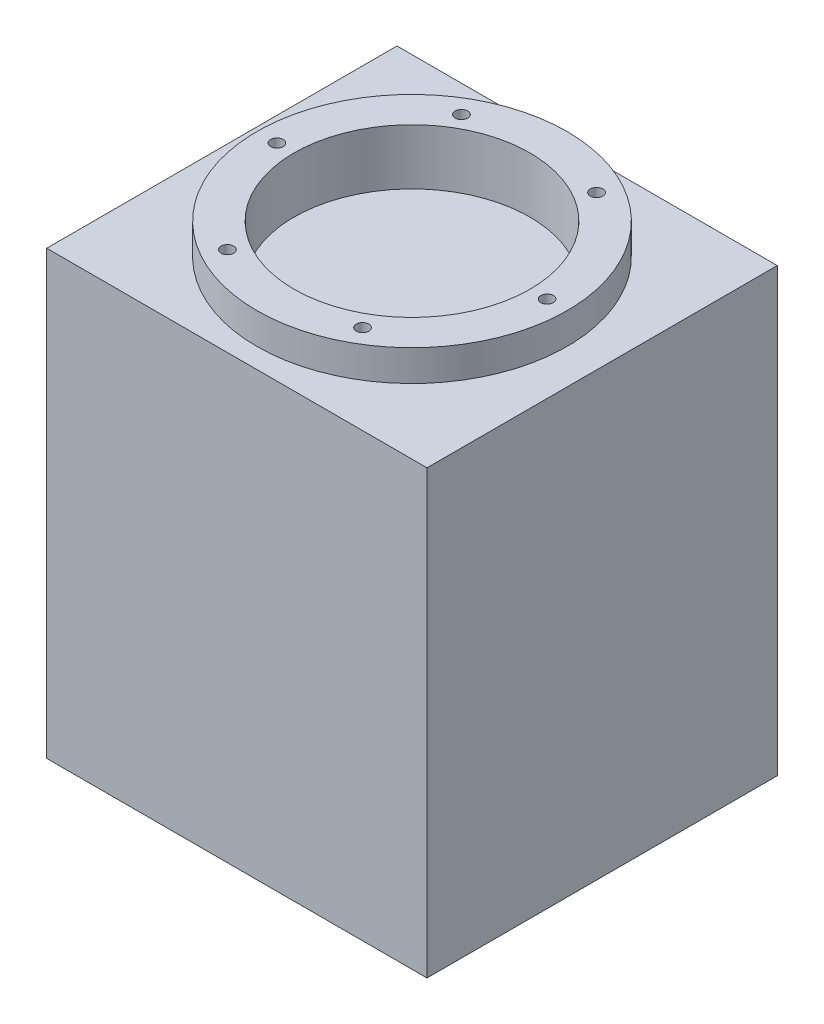
ISO-10303-21;
HEADER;
FILE_DESCRIPTION(('STEP AP214'),'2;1');
FILE_NAME('part.step','',(''),(''),'','','');
FILE_SCHEMA(('AUTOMOTIVE_DESIGN { 1 0 10303 214 1 1 1 1 }'));
ENDSEC;
DATA;
#1=APPLICATION_CONTEXT('core data for automotive mechanical design processes');
#2=APPLICATION_PROTOCOL_DEFINITION('international standard','automotive_design',2000,#1);
#3=PRODUCT_CONTEXT('',#1,'mechanical');
#4=PRODUCT('Part','Part','',(#3));
#5=PRODUCT_RELATED_PRODUCT_CATEGORY('part','',(#4));
#6=PRODUCT_DEFINITION_FORMATION('','',#4);
#7=PRODUCT_DEFINITION_CONTEXT('part definition',#1,'design');
#8=PRODUCT_DEFINITION('design','',#6,#7);
#9=PRODUCT_DEFINITION_SHAPE('','',#8);
#10=(LENGTH_UNIT() NAMED_UNIT(*) SI_UNIT(.MILLI.,.METRE.));
#11=(NAMED_UNIT(*) PLANE_ANGLE_UNIT() SI_UNIT($,.RADIAN.));
#12=(NAMED_UNIT(*) SI_UNIT($,.STERADIAN.) SOLID_ANGLE_UNIT());
#13=UNCERTAINTY_MEASURE_WITH_UNIT(LENGTH_MEASURE(1.E-05),#10,'distance_accuracy_value','');
#14=(GEOMETRIC_REPRESENTATION_CONTEXT(3) GLOBAL_UNCERTAINTY_ASSIGNED_CONTEXT((#13)) GLOBAL_UNIT_ASSIGNED_CONTEXT((#10,
#11,#12)) REPRESENTATION_CONTEXT('',''));
#15=CARTESIAN_POINT('',(0.,0.,0.));
#16=DIRECTION('',(0.,0.,1.));
#17=DIRECTION('',(1.,0.,0.));
#18=AXIS2_PLACEMENT_3D('',#15,#16,#17);
#19=CARTESIAN_POINT('',(38.,88.3,35.));
#20=DIRECTION('',(-1.,0.,0.));
#21=DIRECTION('',(0.,0.,1.));
#22=AXIS2_PLACEMENT_3D('',#19,#20,#21);
#23=PLANE('',#22);
#24=DIRECTION('',(0.,0.,-1.));
#25=VECTOR('',#24,1.);
#26=CARTESIAN_POINT('',(38.,0.,35.));
#27=LINE('',#26,#25);
#28=CARTESIAN_POINT('',(38.,0.,35.));
#29=VERTEX_POINT('',#28);
#30=CARTESIAN_POINT('',(38.,0.,-35.));
#31=VERTEX_POINT('',#30);
#32=EDGE_CURVE('E157',#29,#31,#27,.T.);
#33=ORIENTED_EDGE('',*,*,#32,.T.);
#34=DIRECTION('',(0.,-1.,0.));
#35=VECTOR('',#34,1.);
#36=CARTESIAN_POINT('',(38.,88.3,-35.));
#37=LINE('',#36,#35);
#38=CARTESIAN_POINT('',(38.,88.3,-35.));
#39=VERTEX_POINT('',#38);
#40=EDGE_CURVE('E43',#39,#31,#37,.T.);
#41=ORIENTED_EDGE('',*,*,#40,.F.);
#42=DIRECTION('',(0.,0.,-1.));
#43=VECTOR('',#42,1.);
#44=CARTESIAN_POINT('',(38.,88.3,35.));
#45=LINE('',#44,#43);
#46=CARTESIAN_POINT('',(38.,88.3,35.));
#47=VERTEX_POINT('',#46);
#48=EDGE_CURVE('E159',#47,#39,#45,.T.);
#49=ORIENTED_EDGE('',*,*,#48,.F.);
#50=DIRECTION('',(0.,-1.,0.));
#51=VECTOR('',#50,1.);
#52=CARTESIAN_POINT('',(38.,88.3,35.));
#53=LINE('',#52,#51);
#54=EDGE_CURVE('E165',#47,#29,#53,.T.);
#55=ORIENTED_EDGE('',*,*,#54,.T.);
#56=EDGE_LOOP('',(#33,#41,#49,#55));
#57=FACE_BOUND('',#56,.T.);
#58=ADVANCED_FACE('F40',(#57),#23,.F.);
#59=CARTESIAN_POINT('',(-38.,88.3,-35.));
#60=DIRECTION('',(0.,0.,1.));
#61=DIRECTION('',(1.,0.,0.));
#62=AXIS2_PLACEMENT_3D('',#59,#60,#61);
#63=PLANE('',#62);
#64=DIRECTION('',(-1.,0.,0.));
#65=VECTOR('',#64,1.);
#66=CARTESIAN_POINT('',(-38.,0.,-35.));
#67=LINE('',#66,#65);
#68=CARTESIAN_POINT('',(-38.,0.,-35.));
#69=VERTEX_POINT('',#68);
#70=EDGE_CURVE('E168',#31,#69,#67,.T.);
#71=ORIENTED_EDGE('',*,*,#70,.T.);
#72=DIRECTION('',(0.,-1.,0.));
#73=VECTOR('',#72,1.);
#74=CARTESIAN_POINT('',(-38.,88.3,-35.));
#75=LINE('',#74,#73);
#76=CARTESIAN_POINT('',(-38.,88.3,-35.));
#77=VERTEX_POINT('',#76);
#78=EDGE_CURVE('E174',#77,#69,#75,.T.);
#79=ORIENTED_EDGE('',*,*,#78,.F.);
#80=DIRECTION('',(-1.,0.,0.));
#81=VECTOR('',#80,1.);
#82=CARTESIAN_POINT('',(-38.,88.3,-35.));
#83=LINE('',#82,#81);
#84=EDGE_CURVE('E89',#39,#77,#83,.T.);
#85=ORIENTED_EDGE('',*,*,#84,.F.);
#86=ORIENTED_EDGE('',*,*,#40,.T.);
#87=EDGE_LOOP('',(#71,#79,#85,#86));
#88=FACE_BOUND('',#87,.T.);
#89=ADVANCED_FACE('F177',(#88),#63,.F.);
#90=CARTESIAN_POINT('',(-38.,88.3,35.));
#91=DIRECTION('',(1.,0.,0.));
#92=DIRECTION('',(0.,0.,-1.));
#93=AXIS2_PLACEMENT_3D('',#90,#91,#92);
#94=PLANE('',#93);
#95=DIRECTION('',(0.,0.,1.));
#96=VECTOR('',#95,1.);
#97=CARTESIAN_POINT('',(-38.,0.,35.));
#98=LINE('',#97,#96);
#99=CARTESIAN_POINT('',(-38.,0.,35.));
#100=VERTEX_POINT('',#99);
#101=EDGE_CURVE('E75',#69,#100,#98,.T.);
#102=ORIENTED_EDGE('',*,*,#101,.T.);
#103=DIRECTION('',(0.,-1.,0.));
#104=VECTOR('',#103,1.);
#105=CARTESIAN_POINT('',(-38.,88.3,35.));
#106=LINE('',#105,#104);
#107=CARTESIAN_POINT('',(-38.,88.3,35.));
#108=VERTEX_POINT('',#107);
#109=EDGE_CURVE('E173',#108,#100,#106,.T.);
#110=ORIENTED_EDGE('',*,*,#109,.F.);
#111=DIRECTION('',(0.,0.,1.));
#112=VECTOR('',#111,1.);
#113=CARTESIAN_POINT('',(-38.,88.3,35.));
#114=LINE('',#113,#112);
#115=EDGE_CURVE('E162',#77,#108,#114,.T.);
#116=ORIENTED_EDGE('',*,*,#115,.F.);
#117=ORIENTED_EDGE('',*,*,#78,.T.);
#118=EDGE_LOOP('',(#102,#110,#116,#117));
#119=FACE_BOUND('',#118,.T.);
#120=ADVANCED_FACE('F202',(#119),#94,.F.);
#121=CARTESIAN_POINT('',(-38.,88.3,35.));
#122=DIRECTION('',(0.,0.,-1.));
#123=DIRECTION('',(-1.,0.,0.));
#124=AXIS2_PLACEMENT_3D('',#121,#122,#123);
#125=PLANE('',#124);
#126=DIRECTION('',(1.,0.,0.));
#127=VECTOR('',#126,1.);
#128=CARTESIAN_POINT('',(-38.,0.,35.));
#129=LINE('',#128,#127);
#130=EDGE_CURVE('E81',#100,#29,#129,.T.);
#131=ORIENTED_EDGE('',*,*,#130,.T.);
#132=ORIENTED_EDGE('',*,*,#54,.F.);
#133=DIRECTION('',(1.,0.,0.));
#134=VECTOR('',#133,1.);
#135=CARTESIAN_POINT('',(-38.,88.3,35.));
#136=LINE('',#135,#134);
#137=EDGE_CURVE('E57',#108,#47,#136,.T.);
#138=ORIENTED_EDGE('',*,*,#137,.F.);
#139=ORIENTED_EDGE('',*,*,#109,.T.);
#140=EDGE_LOOP('',(#131,#132,#138,#139));
#141=FACE_BOUND('',#140,.T.);
#142=ADVANCED_FACE('F194',(#141),#125,.F.);
#143=CARTESIAN_POINT('',(0.,88.3,0.));
#144=DIRECTION('',(0.,-1.,0.));
#145=DIRECTION('',(0.,0.,-1.));
#146=AXIS2_PLACEMENT_3D('',#143,#144,#145);
#147=PLANE('',#146);
#148=CARTESIAN_POINT('',(0.,88.3,0.));
#149=DIRECTION('',(0.,1.,0.));
#150=DIRECTION('',(0.,0.,1.));
#151=AXIS2_PLACEMENT_3D('',#148,#149,#150);
#152=CIRCLE('',#151,31.);
#153=CARTESIAN_POINT('',(0.,88.3,31.));
#154=VERTEX_POINT('',#153);
#155=EDGE_CURVE('E11',#154,#154,#152,.T.);
#156=ORIENTED_EDGE('',*,*,#155,.F.);
#157=EDGE_LOOP('',(#156));
#158=FACE_BOUND('',#157,.T.);
#159=ORIENTED_EDGE('',*,*,#48,.T.);
#160=ORIENTED_EDGE('',*,*,#84,.T.);
#161=ORIENTED_EDGE('',*,*,#115,.T.);
#162=ORIENTED_EDGE('',*,*,#137,.T.);
#163=EDGE_LOOP('',(#159,#160,#161,#162));
#164=FACE_BOUND('',#163,.T.);
#165=ADVANCED_FACE('F185',(#158,#164),#147,.F.);
#166=CARTESIAN_POINT('',(0.,0.,0.));
#167=DIRECTION('',(0.,-1.,0.));
#168=DIRECTION('',(0.,0.,-1.));
#169=AXIS2_PLACEMENT_3D('',#166,#167,#168);
#170=PLANE('',#169);
#171=ORIENTED_EDGE('',*,*,#32,.F.);
#172=ORIENTED_EDGE('',*,*,#130,.F.);
#173=ORIENTED_EDGE('',*,*,#101,.F.);
#174=ORIENTED_EDGE('',*,*,#70,.F.);
#175=EDGE_LOOP('',(#171,#172,#173,#174));
#176=FACE_BOUND('',#175,.T.);
#177=ADVANCED_FACE('F182',(#176),#170,.T.);
#178=CARTESIAN_POINT('',(0.,94.5,0.));
#179=DIRECTION('',(0.,-1.,0.));
#180=DIRECTION('',(0.,0.,-1.));
#181=AXIS2_PLACEMENT_3D('',#178,#179,#180);
#182=CYLINDRICAL_SURFACE('',#181,31.);
#183=CARTESIAN_POINT('',(0.,94.5,0.));
#184=DIRECTION('',(0.,1.,0.));
#185=DIRECTION('',(0.,0.,1.));
#186=AXIS2_PLACEMENT_3D('',#183,#184,#185);
#187=CIRCLE('',#186,31.);
#188=CARTESIAN_POINT('',(0.,94.5,31.));
#189=VERTEX_POINT('',#188);
#190=EDGE_CURVE('E155',#189,#189,#187,.T.);
#191=ORIENTED_EDGE('',*,*,#190,.F.);
#192=EDGE_LOOP('',(#191));
#193=FACE_BOUND('',#192,.T.);
#194=ORIENTED_EDGE('',*,*,#155,.T.);
#195=EDGE_LOOP('',(#194));
#196=FACE_BOUND('',#195,.T.);
#197=ADVANCED_FACE('F184',(#193,#196),#182,.T.);
#198=CARTESIAN_POINT('',(0.,94.5,0.));
#199=DIRECTION('',(0.,1.,0.));
#200=DIRECTION('',(0.,0.,1.));
#201=AXIS2_PLACEMENT_3D('',#198,#199,#200);
#202=PLANE('',#201);
#203=CARTESIAN_POINT('',(0.,94.5,0.));
#204=DIRECTION('',(0.,1.,0.));
#205=DIRECTION('',(0.,0.,1.));
#206=AXIS2_PLACEMENT_3D('',#203,#204,#205);
#207=CIRCLE('',#206,23.5888023744465);
#208=CARTESIAN_POINT('',(0.,94.5,23.5888023744465));
#209=VERTEX_POINT('',#208);
#210=EDGE_CURVE('E390',#209,#209,#207,.T.);
#211=ORIENTED_EDGE('',*,*,#210,.F.);
#212=EDGE_LOOP('',(#211));
#213=FACE_BOUND('',#212,.T.);
#214=CARTESIAN_POINT('',(13.5000000000003,94.5,-23.3826859021797));
#215=DIRECTION('',(0.,1.,0.));
#216=DIRECTION('',(0.,0.,1.));
#217=AXIS2_PLACEMENT_3D('',#214,#215,#216);
#218=CIRCLE('',#217,1.24999999999999);
#219=CARTESIAN_POINT('',(13.5000000000003,94.5,-22.1326859021797));
#220=VERTEX_POINT('',#219);
#221=EDGE_CURVE('E119',#220,#220,#218,.T.);
#222=ORIENTED_EDGE('',*,*,#221,.F.);
#223=EDGE_LOOP('',(#222));
#224=FACE_BOUND('',#223,.T.);
#225=CARTESIAN_POINT('',(-13.4999999999998,94.5,-23.38268590218));
#226=DIRECTION('',(0.,1.,0.));
#227=DIRECTION('',(0.,0.,1.));
#228=AXIS2_PLACEMENT_3D('',#225,#226,#227);
#229=CIRCLE('',#228,1.24999999999999);
#230=CARTESIAN_POINT('',(-13.4999999999998,94.5,-22.13268590218));
#231=VERTEX_POINT('',#230);
#232=EDGE_CURVE('E118',#231,#231,#229,.T.);
#233=ORIENTED_EDGE('',*,*,#232,.F.);
#234=EDGE_LOOP('',(#233));
#235=FACE_BOUND('',#234,.T.);
#236=CARTESIAN_POINT('',(-27.,94.5,0.));
#237=DIRECTION('',(0.,1.,0.));
#238=DIRECTION('',(0.,0.,1.));
#239=AXIS2_PLACEMENT_3D('',#236,#237,#238);
#240=CIRCLE('',#239,1.24999999999999);
#241=CARTESIAN_POINT('',(-27.,94.5,1.24999999999999));
#242=VERTEX_POINT('',#241);
#243=EDGE_CURVE('E131',#242,#242,#240,.T.);
#244=ORIENTED_EDGE('',*,*,#243,.F.);
#245=EDGE_LOOP('',(#244));
#246=FACE_BOUND('',#245,.T.);
#247=CARTESIAN_POINT('',(-13.5000000000001,94.5,23.3826859021798));
#248=DIRECTION('',(0.,1.,0.));
#249=DIRECTION('',(0.,0.,1.));
#250=AXIS2_PLACEMENT_3D('',#247,#248,#249);
#251=CIRCLE('',#250,1.24999999999999);
#252=CARTESIAN_POINT('',(-13.5000000000001,94.5,24.6326859021798));
#253=VERTEX_POINT('',#252);
#254=EDGE_CURVE('E137',#253,#253,#251,.T.);
#255=ORIENTED_EDGE('',*,*,#254,.F.);
#256=EDGE_LOOP('',(#255));
#257=FACE_BOUND('',#256,.T.);
#258=CARTESIAN_POINT('',(13.4999999999999,94.5,23.3826859021799));
#259=DIRECTION('',(0.,1.,0.));
#260=DIRECTION('',(0.,0.,1.));
#261=AXIS2_PLACEMENT_3D('',#258,#259,#260);
#262=CIRCLE('',#261,1.24999999999999);
#263=CARTESIAN_POINT('',(13.4999999999999,94.5,24.6326859021799));
#264=VERTEX_POINT('',#263);
#265=EDGE_CURVE('E143',#264,#264,#262,.T.);
#266=ORIENTED_EDGE('',*,*,#265,.F.);
#267=EDGE_LOOP('',(#266));
#268=FACE_BOUND('',#267,.T.);
#269=CARTESIAN_POINT('',(27.,94.5,0.));
#270=DIRECTION('',(0.,1.,0.));
#271=DIRECTION('',(0.,0.,1.));
#272=AXIS2_PLACEMENT_3D('',#269,#270,#271);
#273=CIRCLE('',#272,1.24999999999999);
#274=CARTESIAN_POINT('',(27.,94.5,1.24999999999999));
#275=VERTEX_POINT('',#274);
#276=EDGE_CURVE('E149',#275,#275,#273,.T.);
#277=ORIENTED_EDGE('',*,*,#276,.F.);
#278=EDGE_LOOP('',(#277));
#279=FACE_BOUND('',#278,.T.);
#280=ORIENTED_EDGE('',*,*,#190,.T.);
#281=EDGE_LOOP('',(#280));
#282=FACE_BOUND('',#281,.T.);
#283=ADVANCED_FACE('F191',(#213,#224,#235,#246,#257,#268,#279,#282),#202,.T.);
#284=CARTESIAN_POINT('',(27.,88.,0.));
#285=DIRECTION('',(0.,1.,0.));
#286=DIRECTION('',(0.,0.,1.));
#287=AXIS2_PLACEMENT_3D('',#284,#285,#286);
#288=CONICAL_SURFACE('',#287,1.24999999999999,1.02974425867665);
#289=CARTESIAN_POINT('',(27.,87.2489242262155,0.));
#290=VERTEX_POINT('',#289);
#291=VERTEX_LOOP('',#290);
#292=FACE_BOUND('',#291,.T.);
#293=CARTESIAN_POINT('',(27.,88.,0.));
#294=DIRECTION('',(0.,1.,0.));
#295=DIRECTION('',(0.,0.,1.));
#296=AXIS2_PLACEMENT_3D('',#293,#294,#295);
#297=CIRCLE('',#296,1.24999999999999);
#298=CARTESIAN_POINT('',(27.,88.,1.24999999999999));
#299=VERTEX_POINT('',#298);
#300=EDGE_CURVE('E152',#299,#299,#297,.T.);
#301=ORIENTED_EDGE('',*,*,#300,.T.);
#302=EDGE_LOOP('',(#301));
#303=FACE_BOUND('',#302,.T.);
#304=ADVANCED_FACE('F231',(#292,#303),#288,.F.);
#305=CARTESIAN_POINT('',(27.,94.5,0.));
#306=DIRECTION('',(0.,1.,0.));
#307=DIRECTION('',(0.,0.,1.));
#308=AXIS2_PLACEMENT_3D('',#305,#306,#307);
#309=CYLINDRICAL_SURFACE('',#308,1.24999999999999);
#310=ORIENTED_EDGE('',*,*,#300,.F.);
#311=EDGE_LOOP('',(#310));
#312=FACE_BOUND('',#311,.T.);
#313=ORIENTED_EDGE('',*,*,#276,.T.);
#314=EDGE_LOOP('',(#313));
#315=FACE_BOUND('',#314,.T.);
#316=ADVANCED_FACE('F236',(#312,#315),#309,.F.);
#317=CARTESIAN_POINT('',(13.4999999999999,88.,23.3826859021799));
#318=DIRECTION('',(0.,1.,0.));
#319=DIRECTION('',(0.,0.,1.));
#320=AXIS2_PLACEMENT_3D('',#317,#318,#319);
#321=CONICAL_SURFACE('',#320,1.24999999999999,1.02974425867665);
#322=CARTESIAN_POINT('',(13.4999999999999,87.2489242262155,23.3826859021799));
#323=VERTEX_POINT('',#322);
#324=VERTEX_LOOP('',#323);
#325=FACE_BOUND('',#324,.T.);
#326=CARTESIAN_POINT('',(13.4999999999999,88.,23.3826859021799));
#327=DIRECTION('',(0.,1.,0.));
#328=DIRECTION('',(0.,0.,1.));
#329=AXIS2_PLACEMENT_3D('',#326,#327,#328);
#330=CIRCLE('',#329,1.24999999999999);
#331=CARTESIAN_POINT('',(13.4999999999999,88.,24.6326859021799));
#332=VERTEX_POINT('',#331);
#333=EDGE_CURVE('E146',#332,#332,#330,.T.);
#334=ORIENTED_EDGE('',*,*,#333,.T.);
#335=EDGE_LOOP('',(#334));
#336=FACE_BOUND('',#335,.T.);
#337=ADVANCED_FACE('F247',(#325,#336),#321,.F.);
#338=CARTESIAN_POINT('',(13.4999999999999,94.5,23.3826859021799));
#339=DIRECTION('',(0.,1.,0.));
#340=DIRECTION('',(0.,0.,1.));
#341=AXIS2_PLACEMENT_3D('',#338,#339,#340);
#342=CYLINDRICAL_SURFACE('',#341,1.24999999999999);
#343=ORIENTED_EDGE('',*,*,#333,.F.);
#344=EDGE_LOOP('',(#343));
#345=FACE_BOUND('',#344,.T.);
#346=ORIENTED_EDGE('',*,*,#265,.T.);
#347=EDGE_LOOP('',(#346));
#348=FACE_BOUND('',#347,.T.);
#349=ADVANCED_FACE('F259',(#345,#348),#342,.F.);
#350=CARTESIAN_POINT('',(-13.5000000000001,88.,23.3826859021798));
#351=DIRECTION('',(0.,1.,0.));
#352=DIRECTION('',(0.,0.,1.));
#353=AXIS2_PLACEMENT_3D('',#350,#351,#352);
#354=CONICAL_SURFACE('',#353,1.24999999999999,1.02974425867665);
#355=CARTESIAN_POINT('',(-13.5000000000001,87.2489242262155,23.3826859021798));
#356=VERTEX_POINT('',#355);
#357=VERTEX_LOOP('',#356);
#358=FACE_BOUND('',#357,.T.);
#359=CARTESIAN_POINT('',(-13.5000000000001,88.,23.3826859021798));
#360=DIRECTION('',(0.,1.,0.));
#361=DIRECTION('',(0.,0.,1.));
#362=AXIS2_PLACEMENT_3D('',#359,#360,#361);
#363=CIRCLE('',#362,1.24999999999999);
#364=CARTESIAN_POINT('',(-13.5000000000001,88.,24.6326859021798));
#365=VERTEX_POINT('',#364);
#366=EDGE_CURVE('E140',#365,#365,#363,.T.);
#367=ORIENTED_EDGE('',*,*,#366,.T.);
#368=EDGE_LOOP('',(#367));
#369=FACE_BOUND('',#368,.T.);
#370=ADVANCED_FACE('F270',(#358,#369),#354,.F.);
#371=CARTESIAN_POINT('',(-13.5000000000001,94.5,23.3826859021798));
#372=DIRECTION('',(0.,1.,0.));
#373=DIRECTION('',(0.,0.,1.));
#374=AXIS2_PLACEMENT_3D('',#371,#372,#373);
#375=CYLINDRICAL_SURFACE('',#374,1.24999999999999);
#376=ORIENTED_EDGE('',*,*,#366,.F.);
#377=EDGE_LOOP('',(#376));
#378=FACE_BOUND('',#377,.T.);
#379=ORIENTED_EDGE('',*,*,#254,.T.);
#380=EDGE_LOOP('',(#379));
#381=FACE_BOUND('',#380,.T.);
#382=ADVANCED_FACE('F283',(#378,#381),#375,.F.);
#383=CARTESIAN_POINT('',(-27.,88.,0.));
#384=DIRECTION('',(0.,1.,0.));
#385=DIRECTION('',(0.,0.,1.));
#386=AXIS2_PLACEMENT_3D('',#383,#384,#385);
#387=CONICAL_SURFACE('',#386,1.24999999999999,1.02974425867665);
#388=CARTESIAN_POINT('',(-27.,87.2489242262155,0.));
#389=VERTEX_POINT('',#388);
#390=VERTEX_LOOP('',#389);
#391=FACE_BOUND('',#390,.T.);
#392=CARTESIAN_POINT('',(-27.,88.,0.));
#393=DIRECTION('',(0.,1.,0.));
#394=DIRECTION('',(0.,0.,1.));
#395=AXIS2_PLACEMENT_3D('',#392,#393,#394);
#396=CIRCLE('',#395,1.24999999999999);
#397=CARTESIAN_POINT('',(-27.,88.,1.24999999999999));
#398=VERTEX_POINT('',#397);
#399=EDGE_CURVE('E134',#398,#398,#396,.T.);
#400=ORIENTED_EDGE('',*,*,#399,.T.);
#401=EDGE_LOOP('',(#400));
#402=FACE_BOUND('',#401,.T.);
#403=ADVANCED_FACE('F294',(#391,#402),#387,.F.);
#404=CARTESIAN_POINT('',(-27.,94.5,0.));
#405=DIRECTION('',(0.,1.,0.));
#406=DIRECTION('',(0.,0.,1.));
#407=AXIS2_PLACEMENT_3D('',#404,#405,#406);
#408=CYLINDRICAL_SURFACE('',#407,1.24999999999999);
#409=ORIENTED_EDGE('',*,*,#399,.F.);
#410=EDGE_LOOP('',(#409));
#411=FACE_BOUND('',#410,.T.);
#412=ORIENTED_EDGE('',*,*,#243,.T.);
#413=EDGE_LOOP('',(#412));
#414=FACE_BOUND('',#413,.T.);
#415=ADVANCED_FACE('F307',(#411,#414),#408,.F.);
#416=CARTESIAN_POINT('',(-13.4999999999998,88.,-23.38268590218));
#417=DIRECTION('',(0.,1.,0.));
#418=DIRECTION('',(0.,0.,1.));
#419=AXIS2_PLACEMENT_3D('',#416,#417,#418);
#420=CONICAL_SURFACE('',#419,1.24999999999999,1.02974425867665);
#421=CARTESIAN_POINT('',(-13.4999999999998,87.2489242262155,-23.38268590218));
#422=VERTEX_POINT('',#421);
#423=VERTEX_LOOP('',#422);
#424=FACE_BOUND('',#423,.T.);
#425=CARTESIAN_POINT('',(-13.4999999999998,88.,-23.38268590218));
#426=DIRECTION('',(0.,1.,0.));
#427=DIRECTION('',(0.,0.,1.));
#428=AXIS2_PLACEMENT_3D('',#425,#426,#427);
#429=CIRCLE('',#428,1.24999999999999);
#430=CARTESIAN_POINT('',(-13.4999999999998,88.,-22.13268590218));
#431=VERTEX_POINT('',#430);
#432=EDGE_CURVE('E122',#431,#431,#429,.T.);
#433=ORIENTED_EDGE('',*,*,#432,.T.);
#434=EDGE_LOOP('',(#433));
#435=FACE_BOUND('',#434,.T.);
#436=ADVANCED_FACE('F318',(#424,#435),#420,.F.);
#437=CARTESIAN_POINT('',(-13.4999999999998,94.5,-23.38268590218));
#438=DIRECTION('',(0.,1.,0.));
#439=DIRECTION('',(0.,0.,1.));
#440=AXIS2_PLACEMENT_3D('',#437,#438,#439);
#441=CYLINDRICAL_SURFACE('',#440,1.24999999999999);
#442=ORIENTED_EDGE('',*,*,#432,.F.);
#443=EDGE_LOOP('',(#442));
#444=FACE_BOUND('',#443,.T.);
#445=ORIENTED_EDGE('',*,*,#232,.T.);
#446=EDGE_LOOP('',(#445));
#447=FACE_BOUND('',#446,.T.);
#448=ADVANCED_FACE('F112',(#444,#447),#441,.F.);
#449=CARTESIAN_POINT('',(13.5000000000003,88.,-23.3826859021797));
#450=DIRECTION('',(0.,1.,0.));
#451=DIRECTION('',(0.,0.,1.));
#452=AXIS2_PLACEMENT_3D('',#449,#450,#451);
#453=CONICAL_SURFACE('',#452,1.24999999999999,1.02974425867665);
#454=CARTESIAN_POINT('',(13.5000000000003,87.2489242262155,-23.3826859021797));
#455=VERTEX_POINT('',#454);
#456=VERTEX_LOOP('',#455);
#457=FACE_BOUND('',#456,.T.);
#458=CARTESIAN_POINT('',(13.5000000000003,88.,-23.3826859021797));
#459=DIRECTION('',(0.,1.,0.));
#460=DIRECTION('',(0.,0.,1.));
#461=AXIS2_PLACEMENT_3D('',#458,#459,#460);
#462=CIRCLE('',#461,1.24999999999999);
#463=CARTESIAN_POINT('',(13.5000000000003,88.,-22.1326859021797));
#464=VERTEX_POINT('',#463);
#465=EDGE_CURVE('E116',#464,#464,#462,.T.);
#466=ORIENTED_EDGE('',*,*,#465,.T.);
#467=EDGE_LOOP('',(#466));
#468=FACE_BOUND('',#467,.T.);
#469=ADVANCED_FACE('F108',(#457,#468),#453,.F.);
#470=CARTESIAN_POINT('',(13.5000000000003,94.5,-23.3826859021797));
#471=DIRECTION('',(0.,1.,0.));
#472=DIRECTION('',(0.,0.,1.));
#473=AXIS2_PLACEMENT_3D('',#470,#471,#472);
#474=CYLINDRICAL_SURFACE('',#473,1.24999999999999);
#475=ORIENTED_EDGE('',*,*,#465,.F.);
#476=EDGE_LOOP('',(#475));
#477=FACE_BOUND('',#476,.T.);
#478=ORIENTED_EDGE('',*,*,#221,.T.);
#479=EDGE_LOOP('',(#478));
#480=FACE_BOUND('',#479,.T.);
#481=ADVANCED_FACE('F111',(#477,#480),#474,.F.);
#482=CARTESIAN_POINT('',(0.,83.39,0.));
#483=DIRECTION('',(0.,1.,0.));
#484=DIRECTION('',(0.,0.,1.));
#485=AXIS2_PLACEMENT_3D('',#482,#483,#484);
#486=CYLINDRICAL_SURFACE('',#485,23.5888023744465);
#487=CARTESIAN_POINT('',(0.,83.39,0.));
#488=DIRECTION('',(0.,1.,0.));
#489=DIRECTION('',(0.,0.,1.));
#490=AXIS2_PLACEMENT_3D('',#487,#488,#489);
#491=CIRCLE('',#490,23.5888023744465);
#492=CARTESIAN_POINT('',(0.,83.39,23.5888023744465));
#493=VERTEX_POINT('',#492);
#494=EDGE_CURVE('E125',#493,#493,#491,.T.);
#495=ORIENTED_EDGE('',*,*,#494,.F.);
#496=EDGE_LOOP('',(#495));
#497=FACE_BOUND('',#496,.T.);
#498=ORIENTED_EDGE('',*,*,#210,.T.);
#499=EDGE_LOOP('',(#498));
#500=FACE_BOUND('',#499,.T.);
#501=ADVANCED_FACE('F358',(#497,#500),#486,.F.);
#502=CARTESIAN_POINT('',(0.,83.39,0.));
#503=DIRECTION('',(0.,1.,0.));
#504=DIRECTION('',(0.,0.,1.));
#505=AXIS2_PLACEMENT_3D('',#502,#503,#504);
#506=PLANE('',#505);
#507=ORIENTED_EDGE('',*,*,#494,.T.);
#508=EDGE_LOOP('',(#507));
#509=FACE_BOUND('',#508,.T.);
#510=ADVANCED_FACE('F374',(#509),#506,.T.);
#511=CLOSED_SHELL('',(#58,#89,#120,#142,#165,#177,#197,#283,#304,#316,#337,#349,#370,#382,#403,
#415,#436,#448,#469,#481,#501,#510));
#512=MANIFOLD_SOLID_BREP('B2',#511);
#513=ADVANCED_BREP_SHAPE_REPRESENTATION('',(#18,#512),#14);
#514=SHAPE_DEFINITION_REPRESENTATION(#9,#513);
ENDSEC;
END-ISO-10303-21;
